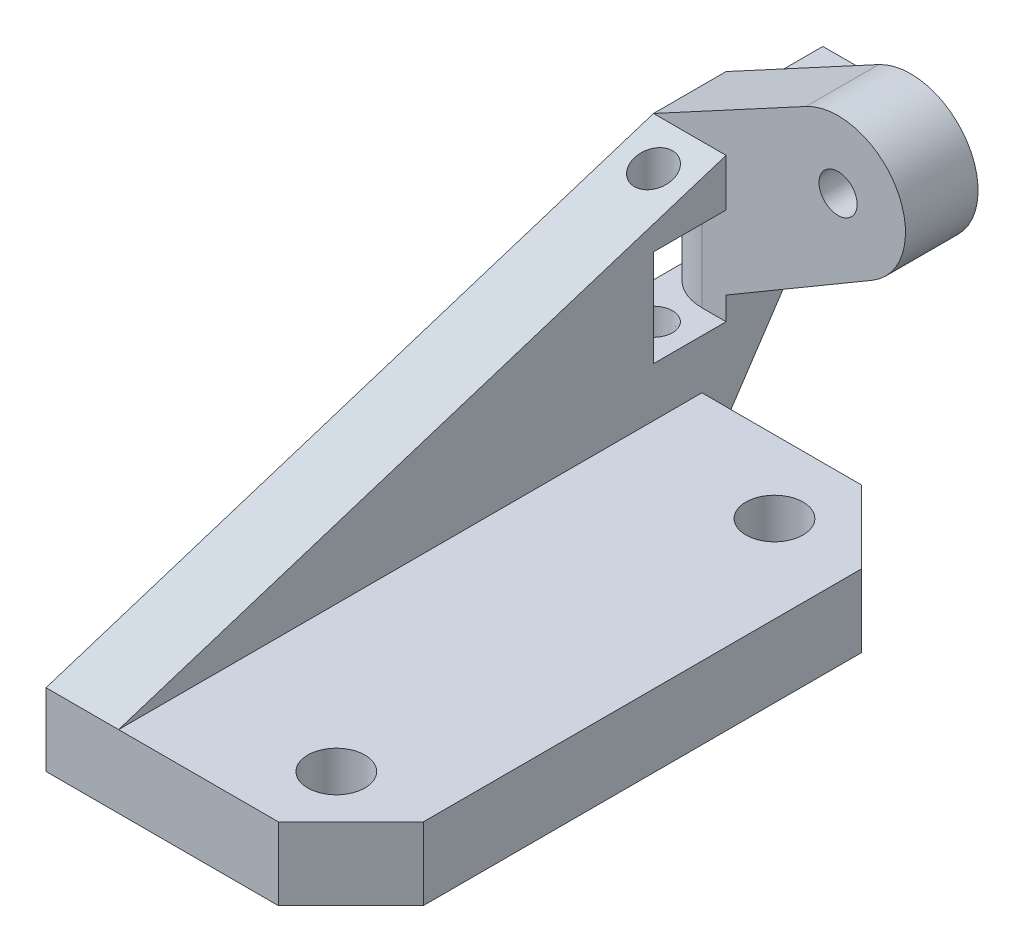
ISO-10303-21;
HEADER;
FILE_DESCRIPTION(('STEP AP214'),'2;1');
FILE_NAME('part.step','',(''),(''),'','','');
FILE_SCHEMA(('AUTOMOTIVE_DESIGN { 1 0 10303 214 1 1 1 1 }'));
ENDSEC;
DATA;
#1=APPLICATION_CONTEXT('core data for automotive mechanical design processes');
#2=APPLICATION_PROTOCOL_DEFINITION('international standard','automotive_design',2000,#1);
#3=PRODUCT_CONTEXT('',#1,'mechanical');
#4=PRODUCT('Part','Part','',(#3));
#5=PRODUCT_RELATED_PRODUCT_CATEGORY('part','',(#4));
#6=PRODUCT_DEFINITION_FORMATION('','',#4);
#7=PRODUCT_DEFINITION_CONTEXT('part definition',#1,'design');
#8=PRODUCT_DEFINITION('design','',#6,#7);
#9=PRODUCT_DEFINITION_SHAPE('','',#8);
#10=(LENGTH_UNIT() NAMED_UNIT(*) SI_UNIT(.MILLI.,.METRE.));
#11=(NAMED_UNIT(*) PLANE_ANGLE_UNIT() SI_UNIT($,.RADIAN.));
#12=(NAMED_UNIT(*) SI_UNIT($,.STERADIAN.) SOLID_ANGLE_UNIT());
#13=UNCERTAINTY_MEASURE_WITH_UNIT(LENGTH_MEASURE(1.E-05),#10,'distance_accuracy_value','');
#14=(GEOMETRIC_REPRESENTATION_CONTEXT(3) GLOBAL_UNCERTAINTY_ASSIGNED_CONTEXT((#13)) GLOBAL_UNIT_ASSIGNED_CONTEXT((#10,
#11,#12)) REPRESENTATION_CONTEXT('',''));
#15=CARTESIAN_POINT('',(0.,0.,0.));
#16=DIRECTION('',(0.,0.,1.));
#17=DIRECTION('',(1.,0.,0.));
#18=AXIS2_PLACEMENT_3D('',#15,#16,#17);
#19=CARTESIAN_POINT('',(-3.81000000000001,7.62,-35.7));
#20=DIRECTION('',(0.,0.,1.));
#21=DIRECTION('',(1.,0.,0.));
#22=AXIS2_PLACEMENT_3D('',#19,#20,#21);
#23=PLANE('',#22);
#24=DIRECTION('',(1.,0.,0.));
#25=VECTOR('',#24,1.);
#26=CARTESIAN_POINT('',(-3.81000000000001,9.398,-35.7));
#27=LINE('',#26,#25);
#28=CARTESIAN_POINT('',(-3.04800000000001,9.398,-35.7));
#29=VERTEX_POINT('',#28);
#30=CARTESIAN_POINT('',(-2.79400000000002,9.398,-35.7));
#31=VERTEX_POINT('',#30);
#32=EDGE_CURVE('E308',#29,#31,#27,.T.);
#33=ORIENTED_EDGE('',*,*,#32,.F.);
#34=DIRECTION('',(0.,-1.,0.));
#35=VECTOR('',#34,1.);
#36=CARTESIAN_POINT('',(-3.04800000000001,7.62,-35.7));
#37=LINE('',#36,#35);
#38=CARTESIAN_POINT('',(-3.04800000000001,10.795,-35.7));
#39=VERTEX_POINT('',#38);
#40=EDGE_CURVE('E53',#29,#39,#37,.F.);
#41=ORIENTED_EDGE('',*,*,#40,.T.);
#42=DIRECTION('',(-1.,0.,0.));
#43=VECTOR('',#42,1.);
#44=CARTESIAN_POINT('',(-3.81000000000001,10.795,-35.7));
#45=LINE('',#44,#43);
#46=CARTESIAN_POINT('',(-2.794,10.795,-35.7));
#47=VERTEX_POINT('',#46);
#48=EDGE_CURVE('E289',#47,#39,#45,.T.);
#49=ORIENTED_EDGE('',*,*,#48,.F.);
#50=DIRECTION('',(-0.707106781186548,-0.707106781186548,0.));
#51=VECTOR('',#50,1.);
#52=CARTESIAN_POINT('',(-4.88950000000001,8.6995,-35.7));
#53=LINE('',#52,#51);
#54=CARTESIAN_POINT('',(-2.03200000000001,11.557,-35.7));
#55=VERTEX_POINT('',#54);
#56=EDGE_CURVE('E415',#47,#55,#53,.F.);
#57=ORIENTED_EDGE('',*,*,#56,.T.);
#58=DIRECTION('',(0.,-1.,0.));
#59=VECTOR('',#58,1.);
#60=CARTESIAN_POINT('',(-2.03200000000001,10.795,-35.7));
#61=LINE('',#60,#59);
#62=CARTESIAN_POINT('',(-2.03200000000001,12.573,-35.7));
#63=VERTEX_POINT('',#62);
#64=EDGE_CURVE('E298',#63,#55,#61,.T.);
#65=ORIENTED_EDGE('',*,*,#64,.F.);
#66=DIRECTION('',(1.,0.,0.));
#67=VECTOR('',#66,1.);
#68=CARTESIAN_POINT('',(-3.81000000000001,12.573,-35.7));
#69=LINE('',#68,#67);
#70=CARTESIAN_POINT('',(-3.81000000000001,12.573,-35.7));
#71=VERTEX_POINT('',#70);
#72=EDGE_CURVE('E281',#71,#63,#69,.T.);
#73=ORIENTED_EDGE('',*,*,#72,.F.);
#74=DIRECTION('',(0.,-1.,0.));
#75=VECTOR('',#74,1.);
#76=CARTESIAN_POINT('',(-3.81000000000001,7.62,-35.7));
#77=LINE('',#76,#75);
#78=CARTESIAN_POINT('',(-3.81000000000001,13.97,-35.7));
#79=VERTEX_POINT('',#78);
#80=EDGE_CURVE('E337',#79,#71,#77,.T.);
#81=ORIENTED_EDGE('',*,*,#80,.F.);
#82=DIRECTION('',(0.879986355874397,0.474998961551391,0.));
#83=VECTOR('',#82,1.);
#84=CARTESIAN_POINT('',(4.19632177855796,18.2916516997954,-35.7));
#85=LINE('',#84,#83);
#86=CARTESIAN_POINT('',(4.19632177855796,18.2916516997954,-35.7));
#87=VERTEX_POINT('',#86);
#88=EDGE_CURVE('E273',#79,#87,#85,.T.);
#89=ORIENTED_EDGE('',*,*,#88,.T.);
#90=CARTESIAN_POINT('',(5.87781810244988,15.1765,-35.7));
#91=DIRECTION('',(0.,0.,-1.));
#92=DIRECTION('',(1.,0.,0.));
#93=AXIS2_PLACEMENT_3D('',#90,#91,#92);
#94=CIRCLE('',#93,3.54);
#95=CARTESIAN_POINT('',(7.67027951888549,12.1238483542026,-35.7));
#96=VERTEX_POINT('',#95);
#97=EDGE_CURVE('E261',#87,#96,#94,.T.);
#98=ORIENTED_EDGE('',*,*,#97,.T.);
#99=DIRECTION('',(-0.8623309733891,-0.506345032891414,0.));
#100=VECTOR('',#99,1.);
#101=CARTESIAN_POINT('',(0.,7.62,-35.7));
#102=LINE('',#101,#100);
#103=CARTESIAN_POINT('',(0.,7.62,-35.7));
#104=VERTEX_POINT('',#103);
#105=EDGE_CURVE('E255',#96,#104,#102,.T.);
#106=ORIENTED_EDGE('',*,*,#105,.T.);
#107=DIRECTION('',(1.,0.,0.));
#108=VECTOR('',#107,1.);
#109=CARTESIAN_POINT('',(-3.81000000000001,7.62,-35.7));
#110=LINE('',#109,#108);
#111=CARTESIAN_POINT('',(-2.03200000000001,7.62,-35.7));
#112=VERTEX_POINT('',#111);
#113=EDGE_CURVE('E356',#112,#104,#110,.T.);
#114=ORIENTED_EDGE('',*,*,#113,.F.);
#115=DIRECTION('',(0.,-1.,0.));
#116=VECTOR('',#115,1.);
#117=CARTESIAN_POINT('',(-2.03200000000001,7.62,-35.7));
#118=LINE('',#117,#116);
#119=CARTESIAN_POINT('',(-2.03200000000001,8.63599999999999,-35.7));
#120=VERTEX_POINT('',#119);
#121=EDGE_CURVE('E313',#120,#112,#118,.T.);
#122=ORIENTED_EDGE('',*,*,#121,.F.);
#123=DIRECTION('',(0.707106781186551,-0.707106781186544,0.));
#124=VECTOR('',#123,1.);
#125=CARTESIAN_POINT('',(-2.41300000000002,9.017,-35.7));
#126=LINE('',#125,#124);
#127=EDGE_CURVE('E417',#120,#31,#126,.F.);
#128=ORIENTED_EDGE('',*,*,#127,.T.);
#129=EDGE_LOOP('',(#33,#41,#49,#57,#65,#73,#81,#89,#98,#106,#114,#122,#128));
#130=FACE_BOUND('',#129,.T.);
#131=CARTESIAN_POINT('',(5.87781810244988,15.1765,-35.7));
#132=DIRECTION('',(0.,0.,-1.));
#133=DIRECTION('',(-1.,0.,0.));
#134=AXIS2_PLACEMENT_3D('',#131,#132,#133);
#135=CIRCLE('',#134,1.);
#136=CARTESIAN_POINT('',(4.87781810244988,15.1765,-35.7));
#137=VERTEX_POINT('',#136);
#138=EDGE_CURVE('E264',#137,#137,#135,.T.);
#139=ORIENTED_EDGE('',*,*,#138,.F.);
#140=EDGE_LOOP('',(#139));
#141=FACE_BOUND('',#140,.T.);
#142=ADVANCED_FACE('F38',(#130,#141),#23,.F.);
#143=CARTESIAN_POINT('',(0.,3.81,0.));
#144=DIRECTION('',(0.,-1.,0.));
#145=DIRECTION('',(0.,0.,-1.));
#146=AXIS2_PLACEMENT_3D('',#143,#144,#145);
#147=PLANE('',#146);
#148=DIRECTION('',(0.,0.,-1.));
#149=VECTOR('',#148,1.);
#150=CARTESIAN_POINT('',(12.192,3.81,0.));
#151=LINE('',#150,#149);
#152=CARTESIAN_POINT('',(12.192,3.81,-3.80999999999999));
#153=VERTEX_POINT('',#152);
#154=CARTESIAN_POINT('',(12.192,3.81,-26.81));
#155=VERTEX_POINT('',#154);
#156=EDGE_CURVE('E381',#153,#155,#151,.T.);
#157=ORIENTED_EDGE('',*,*,#156,.T.);
#158=DIRECTION('',(0.707106781186546,0.,0.707106781186549));
#159=VECTOR('',#158,1.);
#160=CARTESIAN_POINT('',(8.38200000000001,3.81,-30.62));
#161=LINE('',#160,#159);
#162=CARTESIAN_POINT('',(8.38200000000001,3.81,-30.62));
#163=VERTEX_POINT('',#162);
#164=EDGE_CURVE('E442',#155,#163,#161,.F.);
#165=ORIENTED_EDGE('',*,*,#164,.T.);
#166=DIRECTION('',(-1.,0.,0.));
#167=VECTOR('',#166,1.);
#168=CARTESIAN_POINT('',(0.,3.81,-30.62));
#169=LINE('',#168,#167);
#170=CARTESIAN_POINT('',(0.,3.81,-30.62));
#171=VERTEX_POINT('',#170);
#172=EDGE_CURVE('E384',#163,#171,#169,.T.);
#173=ORIENTED_EDGE('',*,*,#172,.T.);
#174=DIRECTION('',(0.,0.,1.));
#175=VECTOR('',#174,1.);
#176=CARTESIAN_POINT('',(0.,3.81,0.));
#177=LINE('',#176,#175);
#178=CARTESIAN_POINT('',(0.,3.81,0.));
#179=VERTEX_POINT('',#178);
#180=EDGE_CURVE('E374',#171,#179,#177,.T.);
#181=ORIENTED_EDGE('',*,*,#180,.T.);
#182=DIRECTION('',(1.,0.,0.));
#183=VECTOR('',#182,1.);
#184=CARTESIAN_POINT('',(0.,3.81,0.));
#185=LINE('',#184,#183);
#186=CARTESIAN_POINT('',(8.38199999999999,3.81,0.));
#187=VERTEX_POINT('',#186);
#188=EDGE_CURVE('E377',#179,#187,#185,.T.);
#189=ORIENTED_EDGE('',*,*,#188,.T.);
#190=DIRECTION('',(-0.70710678118655,0.,0.707106781186545));
#191=VECTOR('',#190,1.);
#192=CARTESIAN_POINT('',(12.192,3.81,-3.80999999999999));
#193=LINE('',#192,#191);
#194=EDGE_CURVE('E440',#187,#153,#193,.F.);
#195=ORIENTED_EDGE('',*,*,#194,.T.);
#196=EDGE_LOOP('',(#157,#165,#173,#181,#189,#195));
#197=FACE_BOUND('',#196,.T.);
#198=CARTESIAN_POINT('',(7.62,3.81,-26.81));
#199=DIRECTION('',(0.,1.,0.));
#200=DIRECTION('',(0.,0.,1.));
#201=AXIS2_PLACEMENT_3D('',#198,#199,#200);
#202=CIRCLE('',#201,1.5);
#203=CARTESIAN_POINT('',(7.62,3.81,-25.31));
#204=VERTEX_POINT('',#203);
#205=EDGE_CURVE('E368',#204,#204,#202,.T.);
#206=ORIENTED_EDGE('',*,*,#205,.F.);
#207=EDGE_LOOP('',(#206));
#208=FACE_BOUND('',#207,.T.);
#209=CARTESIAN_POINT('',(7.62,3.81,-3.81));
#210=DIRECTION('',(0.,1.,0.));
#211=DIRECTION('',(0.,0.,1.));
#212=AXIS2_PLACEMENT_3D('',#209,#210,#211);
#213=CIRCLE('',#212,1.5);
#214=CARTESIAN_POINT('',(7.62,3.81,-2.31));
#215=VERTEX_POINT('',#214);
#216=EDGE_CURVE('E362',#215,#215,#213,.T.);
#217=ORIENTED_EDGE('',*,*,#216,.F.);
#218=EDGE_LOOP('',(#217));
#219=FACE_BOUND('',#218,.T.);
#220=ADVANCED_FACE('F517',(#197,#208,#219),#147,.F.);
#221=CARTESIAN_POINT('',(0.,0.,0.));
#222=DIRECTION('',(0.,-1.,0.));
#223=DIRECTION('',(0.,0.,-1.));
#224=AXIS2_PLACEMENT_3D('',#221,#222,#223);
#225=PLANE('',#224);
#226=CARTESIAN_POINT('',(7.62,0.,-26.81));
#227=DIRECTION('',(0.,1.,0.));
#228=DIRECTION('',(0.,0.,1.));
#229=AXIS2_PLACEMENT_3D('',#226,#227,#228);
#230=CIRCLE('',#229,1.5);
#231=CARTESIAN_POINT('',(7.62,0.,-25.31));
#232=VERTEX_POINT('',#231);
#233=EDGE_CURVE('E365',#232,#232,#230,.T.);
#234=ORIENTED_EDGE('',*,*,#233,.T.);
#235=EDGE_LOOP('',(#234));
#236=FACE_BOUND('',#235,.T.);
#237=DIRECTION('',(-1.,0.,0.));
#238=VECTOR('',#237,1.);
#239=CARTESIAN_POINT('',(0.,0.,-30.62));
#240=LINE('',#239,#238);
#241=CARTESIAN_POINT('',(8.38200000000001,0.,-30.62));
#242=VERTEX_POINT('',#241);
#243=CARTESIAN_POINT('',(0.,0.,-30.62));
#244=VERTEX_POINT('',#243);
#245=EDGE_CURVE('E378',#242,#244,#240,.T.);
#246=ORIENTED_EDGE('',*,*,#245,.F.);
#247=DIRECTION('',(-0.707106781186546,0.,-0.707106781186549));
#248=VECTOR('',#247,1.);
#249=CARTESIAN_POINT('',(19.501,0.,-19.5009999999999));
#250=LINE('',#249,#248);
#251=CARTESIAN_POINT('',(12.192,0.,-26.81));
#252=VERTEX_POINT('',#251);
#253=EDGE_CURVE('E433',#242,#252,#250,.F.);
#254=ORIENTED_EDGE('',*,*,#253,.T.);
#255=DIRECTION('',(0.,0.,-1.));
#256=VECTOR('',#255,1.);
#257=CARTESIAN_POINT('',(12.192,0.,0.));
#258=LINE('',#257,#256);
#259=CARTESIAN_POINT('',(12.192,0.,-3.80999999999999));
#260=VERTEX_POINT('',#259);
#261=EDGE_CURVE('E389',#260,#252,#258,.T.);
#262=ORIENTED_EDGE('',*,*,#261,.F.);
#263=DIRECTION('',(0.70710678118655,0.,-0.707106781186545));
#264=VECTOR('',#263,1.);
#265=CARTESIAN_POINT('',(4.19099999999997,0.,4.19099999999999));
#266=LINE('',#265,#264);
#267=CARTESIAN_POINT('',(8.38199999999999,0.,0.));
#268=VERTEX_POINT('',#267);
#269=EDGE_CURVE('E431',#260,#268,#266,.F.);
#270=ORIENTED_EDGE('',*,*,#269,.T.);
#271=DIRECTION('',(1.,0.,0.));
#272=VECTOR('',#271,1.);
#273=CARTESIAN_POINT('',(0.,0.,0.));
#274=LINE('',#273,#272);
#275=CARTESIAN_POINT('',(-3.81,0.,0.));
#276=VERTEX_POINT('',#275);
#277=EDGE_CURVE('E371',#276,#268,#274,.T.);
#278=ORIENTED_EDGE('',*,*,#277,.F.);
#279=DIRECTION('',(0.,0.,1.));
#280=VECTOR('',#279,1.);
#281=CARTESIAN_POINT('',(-3.81000000000001,0.,-30.62));
#282=LINE('',#281,#280);
#283=CARTESIAN_POINT('',(-3.81000000000001,0.,-30.62));
#284=VERTEX_POINT('',#283);
#285=EDGE_CURVE('E342',#284,#276,#282,.T.);
#286=ORIENTED_EDGE('',*,*,#285,.F.);
#287=DIRECTION('',(1.,0.,0.));
#288=VECTOR('',#287,1.);
#289=CARTESIAN_POINT('',(-3.81000000000001,0.,-30.62));
#290=LINE('',#289,#288);
#291=EDGE_CURVE('E353',#284,#244,#290,.T.);
#292=ORIENTED_EDGE('',*,*,#291,.T.);
#293=EDGE_LOOP('',(#246,#254,#262,#270,#278,#286,#292));
#294=FACE_BOUND('',#293,.T.);
#295=CARTESIAN_POINT('',(7.62,0.,-3.81));
#296=DIRECTION('',(0.,1.,0.));
#297=DIRECTION('',(0.,0.,1.));
#298=AXIS2_PLACEMENT_3D('',#295,#296,#297);
#299=CIRCLE('',#298,1.5);
#300=CARTESIAN_POINT('',(7.62,0.,-2.31));
#301=VERTEX_POINT('',#300);
#302=EDGE_CURVE('E361',#301,#301,#299,.T.);
#303=ORIENTED_EDGE('',*,*,#302,.T.);
#304=EDGE_LOOP('',(#303));
#305=FACE_BOUND('',#304,.T.);
#306=ADVANCED_FACE('F507',(#236,#294,#305),#225,.T.);
#307=CARTESIAN_POINT('',(0.,3.81,0.));
#308=DIRECTION('',(0.,0.,-1.));
#309=DIRECTION('',(-1.,0.,0.));
#310=AXIS2_PLACEMENT_3D('',#307,#308,#309);
#311=PLANE('',#310);
#312=ORIENTED_EDGE('',*,*,#277,.T.);
#313=DIRECTION('',(0.,1.,0.));
#314=VECTOR('',#313,1.);
#315=CARTESIAN_POINT('',(8.38199999999999,3.81,0.));
#316=LINE('',#315,#314);
#317=EDGE_CURVE('E444',#268,#187,#316,.T.);
#318=ORIENTED_EDGE('',*,*,#317,.T.);
#319=ORIENTED_EDGE('',*,*,#188,.F.);
#320=DIRECTION('',(1.,0.,0.));
#321=VECTOR('',#320,1.);
#322=CARTESIAN_POINT('',(-3.81,3.81,0.));
#323=LINE('',#322,#321);
#324=CARTESIAN_POINT('',(-3.81,3.81,0.));
#325=VERTEX_POINT('',#324);
#326=EDGE_CURVE('E347',#325,#179,#323,.T.);
#327=ORIENTED_EDGE('',*,*,#326,.F.);
#328=DIRECTION('',(0.,1.,0.));
#329=VECTOR('',#328,1.);
#330=CARTESIAN_POINT('',(-3.81,3.81,0.));
#331=LINE('',#330,#329);
#332=EDGE_CURVE('E345',#276,#325,#331,.T.);
#333=ORIENTED_EDGE('',*,*,#332,.F.);
#334=EDGE_LOOP('',(#312,#318,#319,#327,#333));
#335=FACE_BOUND('',#334,.T.);
#336=ADVANCED_FACE('F512',(#335),#311,.F.);
#337=CARTESIAN_POINT('',(12.192,3.81,0.));
#338=DIRECTION('',(-1.,0.,0.));
#339=DIRECTION('',(0.,0.,1.));
#340=AXIS2_PLACEMENT_3D('',#337,#338,#339);
#341=PLANE('',#340);
#342=ORIENTED_EDGE('',*,*,#261,.T.);
#343=DIRECTION('',(0.,1.,0.));
#344=VECTOR('',#343,1.);
#345=CARTESIAN_POINT('',(12.192,3.81,-26.81));
#346=LINE('',#345,#344);
#347=EDGE_CURVE('E438',#252,#155,#346,.T.);
#348=ORIENTED_EDGE('',*,*,#347,.T.);
#349=ORIENTED_EDGE('',*,*,#156,.F.);
#350=DIRECTION('',(0.,-1.,0.));
#351=VECTOR('',#350,1.);
#352=CARTESIAN_POINT('',(12.192,3.81,-3.80999999999999));
#353=LINE('',#352,#351);
#354=EDGE_CURVE('E435',#153,#260,#353,.T.);
#355=ORIENTED_EDGE('',*,*,#354,.T.);
#356=EDGE_LOOP('',(#342,#348,#349,#355));
#357=FACE_BOUND('',#356,.T.);
#358=ADVANCED_FACE('F530',(#357),#341,.F.);
#359=CARTESIAN_POINT('',(0.,3.81,-30.62));
#360=DIRECTION('',(0.,0.,1.));
#361=DIRECTION('',(1.,0.,0.));
#362=AXIS2_PLACEMENT_3D('',#359,#360,#361);
#363=PLANE('',#362);
#364=ORIENTED_EDGE('',*,*,#172,.F.);
#365=DIRECTION('',(0.,-1.,0.));
#366=VECTOR('',#365,1.);
#367=CARTESIAN_POINT('',(8.38200000000001,3.81,-30.62));
#368=LINE('',#367,#366);
#369=EDGE_CURVE('E428',#163,#242,#368,.T.);
#370=ORIENTED_EDGE('',*,*,#369,.T.);
#371=ORIENTED_EDGE('',*,*,#245,.T.);
#372=DIRECTION('',(0.,-1.,0.));
#373=VECTOR('',#372,1.);
#374=CARTESIAN_POINT('',(0.,3.81,-30.62));
#375=LINE('',#374,#373);
#376=EDGE_CURVE('E386',#171,#244,#375,.T.);
#377=ORIENTED_EDGE('',*,*,#376,.F.);
#378=EDGE_LOOP('',(#364,#370,#371,#377));
#379=FACE_BOUND('',#378,.T.);
#380=ADVANCED_FACE('F524',(#379),#363,.F.);
#381=CARTESIAN_POINT('',(7.62,3.81,-26.81));
#382=DIRECTION('',(0.,-1.,0.));
#383=DIRECTION('',(0.,0.,-1.));
#384=AXIS2_PLACEMENT_3D('',#381,#382,#383);
#385=CYLINDRICAL_SURFACE('',#384,1.5);
#386=ORIENTED_EDGE('',*,*,#205,.T.);
#387=EDGE_LOOP('',(#386));
#388=FACE_BOUND('',#387,.T.);
#389=ORIENTED_EDGE('',*,*,#233,.F.);
#390=EDGE_LOOP('',(#389));
#391=FACE_BOUND('',#390,.T.);
#392=ADVANCED_FACE('F558',(#388,#391),#385,.F.);
#393=CARTESIAN_POINT('',(7.62,3.81,-3.81));
#394=DIRECTION('',(0.,-1.,0.));
#395=DIRECTION('',(0.,0.,-1.));
#396=AXIS2_PLACEMENT_3D('',#393,#394,#395);
#397=CYLINDRICAL_SURFACE('',#396,1.5);
#398=ORIENTED_EDGE('',*,*,#216,.T.);
#399=EDGE_LOOP('',(#398));
#400=FACE_BOUND('',#399,.T.);
#401=ORIENTED_EDGE('',*,*,#302,.F.);
#402=EDGE_LOOP('',(#401));
#403=FACE_BOUND('',#402,.T.);
#404=ADVANCED_FACE('F555',(#400,#403),#397,.F.);
#405=CARTESIAN_POINT('',(0.,0.,0.));
#406=DIRECTION('',(1.,0.,0.));
#407=DIRECTION('',(0.,0.,-1.));
#408=AXIS2_PLACEMENT_3D('',#405,#406,#407);
#409=PLANE('',#408);
#410=DIRECTION('',(0.,-1.,0.));
#411=VECTOR('',#410,1.);
#412=CARTESIAN_POINT('',(0.,11.4861523988711,-31.89));
#413=LINE('',#412,#411);
#414=CARTESIAN_POINT('',(0.,7.62,-31.89));
#415=VERTEX_POINT('',#414);
#416=CARTESIAN_POINT('',(0.,6.40615239887112,-31.89));
#417=VERTEX_POINT('',#416);
#418=EDGE_CURVE('E247',#415,#417,#413,.T.);
#419=ORIENTED_EDGE('',*,*,#418,.T.);
#420=DIRECTION('',(0.,0.,1.));
#421=VECTOR('',#420,1.);
#422=CARTESIAN_POINT('',(0.,6.40615239887112,-31.89));
#423=LINE('',#422,#421);
#424=CARTESIAN_POINT('',(0.,6.40615239887112,-28.08));
#425=VERTEX_POINT('',#424);
#426=EDGE_CURVE('E235',#417,#425,#423,.T.);
#427=ORIENTED_EDGE('',*,*,#426,.T.);
#428=DIRECTION('',(0.,1.,0.));
#429=VECTOR('',#428,1.);
#430=CARTESIAN_POINT('',(0.,11.4861523988711,-28.08));
#431=LINE('',#430,#429);
#432=CARTESIAN_POINT('',(0.,11.4861523988711,-28.08));
#433=VERTEX_POINT('',#432);
#434=EDGE_CURVE('E246',#425,#433,#431,.T.);
#435=ORIENTED_EDGE('',*,*,#434,.T.);
#436=DIRECTION('',(0.,0.,-1.));
#437=VECTOR('',#436,1.);
#438=CARTESIAN_POINT('',(0.,11.4861523988711,-31.89));
#439=LINE('',#438,#437);
#440=CARTESIAN_POINT('',(0.,11.4861523988711,-31.89));
#441=VERTEX_POINT('',#440);
#442=EDGE_CURVE('E227',#433,#441,#439,.T.);
#443=ORIENTED_EDGE('',*,*,#442,.T.);
#444=DIRECTION('',(0.,1.,0.));
#445=VECTOR('',#444,1.);
#446=CARTESIAN_POINT('',(0.,13.97,-31.89));
#447=LINE('',#446,#445);
#448=CARTESIAN_POINT('',(0.,13.97,-31.89));
#449=VERTEX_POINT('',#448);
#450=EDGE_CURVE('E243',#441,#449,#447,.T.);
#451=ORIENTED_EDGE('',*,*,#450,.T.);
#452=DIRECTION('',(0.,0.303561275960176,-0.952811918343505));
#453=VECTOR('',#452,1.);
#454=CARTESIAN_POINT('',(0.,13.97,-31.89));
#455=LINE('',#454,#453);
#456=EDGE_CURVE('E329',#179,#449,#455,.T.);
#457=ORIENTED_EDGE('',*,*,#456,.F.);
#458=ORIENTED_EDGE('',*,*,#180,.F.);
#459=ORIENTED_EDGE('',*,*,#376,.T.);
#460=DIRECTION('',(0.,-0.832050294337844,0.554700196225229));
#461=VECTOR('',#460,1.);
#462=CARTESIAN_POINT('',(0.,0.,-30.62));
#463=LINE('',#462,#461);
#464=EDGE_CURVE('E334',#104,#244,#463,.T.);
#465=ORIENTED_EDGE('',*,*,#464,.F.);
#466=DIRECTION('',(0.,0.,-1.));
#467=VECTOR('',#466,1.);
#468=CARTESIAN_POINT('',(0.,7.62,-31.89));
#469=LINE('',#468,#467);
#470=EDGE_CURVE('E279',#415,#104,#469,.T.);
#471=ORIENTED_EDGE('',*,*,#470,.F.);
#472=EDGE_LOOP('',(#419,#427,#435,#443,#451,#457,#458,#459,#465,#471));
#473=FACE_BOUND('',#472,.T.);
#474=ADVANCED_FACE('F241',(#473),#409,.T.);
#475=CARTESIAN_POINT('',(-3.81000000000001,13.97,-31.89));
#476=DIRECTION('',(0.,-0.952811918343505,-0.303561275960176));
#477=DIRECTION('',(0.,0.303561275960176,-0.952811918343505));
#478=AXIS2_PLACEMENT_3D('',#475,#476,#477);
#479=PLANE('',#478);
#480=CARTESIAN_POINT('',(-1.905,13.3630761994356,-29.985));
#481=DIRECTION('',(0.,-0.952811918343505,-0.303561275960176));
#482=DIRECTION('',(0.,-0.303561275960176,0.952811918343505));
#483=AXIS2_PLACEMENT_3D('',#480,#481,#482);
#484=ELLIPSE('',#483,1.04952507493665,1.);
#485=CARTESIAN_POINT('',(-1.905,13.0444810285356,-28.985));
#486=VERTEX_POINT('',#485);
#487=EDGE_CURVE('E916',#486,#486,#484,.F.);
#488=ORIENTED_EDGE('',*,*,#487,.F.);
#489=EDGE_LOOP('',(#488));
#490=FACE_BOUND('',#489,.T.);
#491=ORIENTED_EDGE('',*,*,#456,.T.);
#492=DIRECTION('',(1.,0.,0.));
#493=VECTOR('',#492,1.);
#494=CARTESIAN_POINT('',(-3.81000000000001,13.97,-31.89));
#495=LINE('',#494,#493);
#496=CARTESIAN_POINT('',(-3.81000000000001,13.97,-31.89));
#497=VERTEX_POINT('',#496);
#498=EDGE_CURVE('E252',#497,#449,#495,.T.);
#499=ORIENTED_EDGE('',*,*,#498,.F.);
#500=DIRECTION('',(0.,0.303561275960176,-0.952811918343505));
#501=VECTOR('',#500,1.);
#502=CARTESIAN_POINT('',(-3.81000000000001,13.97,-31.89));
#503=LINE('',#502,#501);
#504=EDGE_CURVE('E330',#325,#497,#503,.T.);
#505=ORIENTED_EDGE('',*,*,#504,.F.);
#506=ORIENTED_EDGE('',*,*,#326,.T.);
#507=EDGE_LOOP('',(#491,#499,#505,#506));
#508=FACE_BOUND('',#507,.T.);
#509=ADVANCED_FACE('F515',(#490,#508),#479,.F.);
#510=CARTESIAN_POINT('',(-3.81000000000001,0.,-30.62));
#511=DIRECTION('',(0.,0.554700196225229,0.832050294337843));
#512=DIRECTION('',(0.,-0.832050294337844,0.554700196225229));
#513=AXIS2_PLACEMENT_3D('',#510,#511,#512);
#514=PLANE('',#513);
#515=ORIENTED_EDGE('',*,*,#464,.T.);
#516=ORIENTED_EDGE('',*,*,#291,.F.);
#517=DIRECTION('',(0.,-0.832050294337844,0.554700196225229));
#518=VECTOR('',#517,1.);
#519=CARTESIAN_POINT('',(-3.81000000000001,0.,-30.62));
#520=LINE('',#519,#518);
#521=CARTESIAN_POINT('',(-3.81000000000001,7.62,-35.7));
#522=VERTEX_POINT('',#521);
#523=EDGE_CURVE('E340',#522,#284,#520,.T.);
#524=ORIENTED_EDGE('',*,*,#523,.F.);
#525=EDGE_CURVE('E357',#522,#112,#110,.T.);
#526=ORIENTED_EDGE('',*,*,#525,.T.);
#527=ORIENTED_EDGE('',*,*,#113,.T.);
#528=EDGE_LOOP('',(#515,#516,#524,#526,#527));
#529=FACE_BOUND('',#528,.T.);
#530=ADVANCED_FACE('F503',(#529),#514,.F.);
#531=CARTESIAN_POINT('',(-3.81,0.,0.));
#532=DIRECTION('',(1.,0.,0.));
#533=DIRECTION('',(0.,0.,-1.));
#534=AXIS2_PLACEMENT_3D('',#531,#532,#533);
#535=PLANE('',#534);
#536=DIRECTION('',(0.,0.,1.));
#537=VECTOR('',#536,1.);
#538=CARTESIAN_POINT('',(-3.81000000000001,6.40615239887112,-31.89));
#539=LINE('',#538,#537);
#540=CARTESIAN_POINT('',(-3.81000000000001,6.40615239887112,-34.43));
#541=VERTEX_POINT('',#540);
#542=CARTESIAN_POINT('',(-3.81000000000001,6.40615239887112,-28.08));
#543=VERTEX_POINT('',#542);
#544=EDGE_CURVE('E910',#541,#543,#539,.T.);
#545=ORIENTED_EDGE('',*,*,#544,.F.);
#546=DIRECTION('',(0.,-1.,0.));
#547=VECTOR('',#546,1.);
#548=CARTESIAN_POINT('',(-3.81000000000001,11.4861523988711,-34.43));
#549=LINE('',#548,#547);
#550=CARTESIAN_POINT('',(-3.81000000000001,11.4861523988711,-34.43));
#551=VERTEX_POINT('',#550);
#552=EDGE_CURVE('E421',#541,#551,#549,.F.);
#553=ORIENTED_EDGE('',*,*,#552,.T.);
#554=DIRECTION('',(0.,0.,-1.));
#555=VECTOR('',#554,1.);
#556=CARTESIAN_POINT('',(-3.81000000000001,11.4861523988711,-31.89));
#557=LINE('',#556,#555);
#558=CARTESIAN_POINT('',(-3.81000000000001,11.4861523988711,-28.08));
#559=VERTEX_POINT('',#558);
#560=EDGE_CURVE('E608',#559,#551,#557,.T.);
#561=ORIENTED_EDGE('',*,*,#560,.F.);
#562=DIRECTION('',(0.,1.,0.));
#563=VECTOR('',#562,1.);
#564=CARTESIAN_POINT('',(-3.81000000000001,11.4861523988711,-28.08));
#565=LINE('',#564,#563);
#566=EDGE_CURVE('E611',#543,#559,#565,.T.);
#567=ORIENTED_EDGE('',*,*,#566,.F.);
#568=EDGE_LOOP('',(#545,#553,#561,#567));
#569=FACE_BOUND('',#568,.T.);
#570=DIRECTION('',(0.,-1.,0.));
#571=VECTOR('',#570,1.);
#572=CARTESIAN_POINT('',(-3.81000000000001,0.,-34.938));
#573=LINE('',#572,#571);
#574=CARTESIAN_POINT('',(-3.81000000000001,10.795,-34.938));
#575=VERTEX_POINT('',#574);
#576=CARTESIAN_POINT('',(-3.81000000000001,8.63599999999999,-34.938));
#577=VERTEX_POINT('',#576);
#578=EDGE_CURVE('E446',#575,#577,#573,.T.);
#579=ORIENTED_EDGE('',*,*,#578,.T.);
#580=DIRECTION('',(0.,0.,-1.));
#581=VECTOR('',#580,1.);
#582=CARTESIAN_POINT('',(-3.81,8.63599999999999,0.));
#583=LINE('',#582,#581);
#584=CARTESIAN_POINT('',(-3.81000000000001,8.63599999999999,-40.78));
#585=VERTEX_POINT('',#584);
#586=EDGE_CURVE('E61',#577,#585,#583,.T.);
#587=ORIENTED_EDGE('',*,*,#586,.T.);
#588=DIRECTION('',(0.,1.,0.));
#589=VECTOR('',#588,1.);
#590=CARTESIAN_POINT('',(-3.81000000000001,7.62,-40.78));
#591=LINE('',#590,#589);
#592=CARTESIAN_POINT('',(-3.81000000000001,7.62,-40.78));
#593=VERTEX_POINT('',#592);
#594=EDGE_CURVE('E309',#593,#585,#591,.T.);
#595=ORIENTED_EDGE('',*,*,#594,.F.);
#596=DIRECTION('',(0.,0.,1.));
#597=VECTOR('',#596,1.);
#598=CARTESIAN_POINT('',(-3.81000000000001,7.62,-40.78));
#599=LINE('',#598,#597);
#600=EDGE_CURVE('E320',#593,#522,#599,.T.);
#601=ORIENTED_EDGE('',*,*,#600,.T.);
#602=ORIENTED_EDGE('',*,*,#523,.T.);
#603=ORIENTED_EDGE('',*,*,#285,.T.);
#604=ORIENTED_EDGE('',*,*,#332,.T.);
#605=ORIENTED_EDGE('',*,*,#504,.T.);
#606=DIRECTION('',(0.,0.,-1.));
#607=VECTOR('',#606,1.);
#608=CARTESIAN_POINT('',(-3.81000000000001,13.97,-35.7));
#609=LINE('',#608,#607);
#610=EDGE_CURVE('E333',#497,#79,#609,.T.);
#611=ORIENTED_EDGE('',*,*,#610,.T.);
#612=ORIENTED_EDGE('',*,*,#80,.T.);
#613=DIRECTION('',(0.,0.,1.));
#614=VECTOR('',#613,1.);
#615=CARTESIAN_POINT('',(-3.81000000000001,12.573,-40.78));
#616=LINE('',#615,#614);
#617=CARTESIAN_POINT('',(-3.81000000000001,12.573,-40.78));
#618=VERTEX_POINT('',#617);
#619=EDGE_CURVE('E306',#618,#71,#616,.T.);
#620=ORIENTED_EDGE('',*,*,#619,.F.);
#621=DIRECTION('',(0.,1.,0.));
#622=VECTOR('',#621,1.);
#623=CARTESIAN_POINT('',(-3.81000000000001,10.795,-40.78));
#624=LINE('',#623,#622);
#625=CARTESIAN_POINT('',(-3.81000000000001,10.795,-40.78));
#626=VERTEX_POINT('',#625);
#627=EDGE_CURVE('E285',#626,#618,#624,.T.);
#628=ORIENTED_EDGE('',*,*,#627,.F.);
#629=DIRECTION('',(0.,0.,1.));
#630=VECTOR('',#629,1.);
#631=CARTESIAN_POINT('',(-3.81000000000001,10.795,-40.78));
#632=LINE('',#631,#630);
#633=EDGE_CURVE('E296',#626,#575,#632,.T.);
#634=ORIENTED_EDGE('',*,*,#633,.T.);
#635=EDGE_LOOP('',(#579,#587,#595,#601,#602,#603,#604,#605,#611,#612,#620,#628,#634));
#636=FACE_BOUND('',#635,.T.);
#637=ADVANCED_FACE('F483',(#569,#636),#535,.F.);
#638=CARTESIAN_POINT('',(-3.81000000000001,9.398,-40.78));
#639=DIRECTION('',(0.,-1.,0.));
#640=DIRECTION('',(0.,0.,-1.));
#641=AXIS2_PLACEMENT_3D('',#638,#639,#640);
#642=PLANE('',#641);
#643=ORIENTED_EDGE('',*,*,#32,.T.);
#644=DIRECTION('',(0.,0.,-1.));
#645=VECTOR('',#644,1.);
#646=CARTESIAN_POINT('',(-2.79400000000002,9.398,-40.78));
#647=LINE('',#646,#645);
#648=CARTESIAN_POINT('',(-2.79400000000002,9.398,-40.78));
#649=VERTEX_POINT('',#648);
#650=EDGE_CURVE('E408',#31,#649,#647,.T.);
#651=ORIENTED_EDGE('',*,*,#650,.T.);
#652=DIRECTION('',(1.,0.,0.));
#653=VECTOR('',#652,1.);
#654=CARTESIAN_POINT('',(-3.81000000000001,9.398,-40.78));
#655=LINE('',#654,#653);
#656=CARTESIAN_POINT('',(-3.04800000000001,9.398,-40.78));
#657=VERTEX_POINT('',#656);
#658=EDGE_CURVE('E312',#657,#649,#655,.T.);
#659=ORIENTED_EDGE('',*,*,#658,.F.);
#660=DIRECTION('',(0.,0.,1.));
#661=VECTOR('',#660,1.);
#662=CARTESIAN_POINT('',(-3.04800000000001,9.398,-40.78));
#663=LINE('',#662,#661);
#664=EDGE_CURVE('E405',#657,#29,#663,.T.);
#665=ORIENTED_EDGE('',*,*,#664,.T.);
#666=EDGE_LOOP('',(#643,#651,#659,#665));
#667=FACE_BOUND('',#666,.T.);
#668=ADVANCED_FACE('F455',(#667),#642,.F.);
#669=CARTESIAN_POINT('',(-2.03200000000001,7.62,-40.78));
#670=DIRECTION('',(-1.,0.,0.));
#671=DIRECTION('',(0.,0.,1.));
#672=AXIS2_PLACEMENT_3D('',#669,#670,#671);
#673=PLANE('',#672);
#674=DIRECTION('',(0.,-1.,0.));
#675=VECTOR('',#674,1.);
#676=CARTESIAN_POINT('',(-2.03200000000001,7.62,-40.78));
#677=LINE('',#676,#675);
#678=CARTESIAN_POINT('',(-2.03200000000001,8.63599999999999,-40.78));
#679=VERTEX_POINT('',#678);
#680=CARTESIAN_POINT('',(-2.03200000000001,7.62,-40.78));
#681=VERTEX_POINT('',#680);
#682=EDGE_CURVE('E316',#679,#681,#677,.T.);
#683=ORIENTED_EDGE('',*,*,#682,.F.);
#684=DIRECTION('',(0.,0.,1.));
#685=VECTOR('',#684,1.);
#686=CARTESIAN_POINT('',(-2.03200000000001,8.63599999999999,-40.78));
#687=LINE('',#686,#685);
#688=EDGE_CURVE('E402',#679,#120,#687,.T.);
#689=ORIENTED_EDGE('',*,*,#688,.T.);
#690=ORIENTED_EDGE('',*,*,#121,.T.);
#691=DIRECTION('',(0.,0.,1.));
#692=VECTOR('',#691,1.);
#693=CARTESIAN_POINT('',(-2.03200000000001,7.62,-40.78));
#694=LINE('',#693,#692);
#695=EDGE_CURVE('E326',#681,#112,#694,.T.);
#696=ORIENTED_EDGE('',*,*,#695,.F.);
#697=EDGE_LOOP('',(#683,#689,#690,#696));
#698=FACE_BOUND('',#697,.T.);
#699=ADVANCED_FACE('F657',(#698),#673,.F.);
#700=CARTESIAN_POINT('',(-3.81000000000001,7.62,-40.78));
#701=DIRECTION('',(0.,1.,0.));
#702=DIRECTION('',(-1.,0.,0.));
#703=AXIS2_PLACEMENT_3D('',#700,#701,#702);
#704=PLANE('',#703);
#705=ORIENTED_EDGE('',*,*,#525,.F.);
#706=ORIENTED_EDGE('',*,*,#600,.F.);
#707=DIRECTION('',(-1.,0.,0.));
#708=VECTOR('',#707,1.);
#709=CARTESIAN_POINT('',(-3.81000000000001,7.62,-40.78));
#710=LINE('',#709,#708);
#711=EDGE_CURVE('E318',#681,#593,#710,.T.);
#712=ORIENTED_EDGE('',*,*,#711,.F.);
#713=ORIENTED_EDGE('',*,*,#695,.T.);
#714=EDGE_LOOP('',(#705,#706,#712,#713));
#715=FACE_BOUND('',#714,.T.);
#716=ADVANCED_FACE('F653',(#715),#704,.F.);
#717=CARTESIAN_POINT('',(0.,0.,-40.78));
#718=DIRECTION('',(0.,0.,-1.));
#719=DIRECTION('',(-1.,0.,0.));
#720=AXIS2_PLACEMENT_3D('',#717,#718,#719);
#721=PLANE('',#720);
#722=ORIENTED_EDGE('',*,*,#658,.T.);
#723=DIRECTION('',(-0.707106781186551,0.707106781186544,0.));
#724=VECTOR('',#723,1.);
#725=CARTESIAN_POINT('',(3.302,3.30200000000003,-40.78));
#726=LINE('',#725,#724);
#727=EDGE_CURVE('E412',#649,#679,#726,.F.);
#728=ORIENTED_EDGE('',*,*,#727,.T.);
#729=ORIENTED_EDGE('',*,*,#682,.T.);
#730=ORIENTED_EDGE('',*,*,#711,.T.);
#731=ORIENTED_EDGE('',*,*,#594,.T.);
#732=DIRECTION('',(-0.707106781186544,-0.707106781186551,0.));
#733=VECTOR('',#732,1.);
#734=CARTESIAN_POINT('',(-6.22300000000002,6.22299999999996,-40.78));
#735=LINE('',#734,#733);
#736=EDGE_CURVE('E410',#585,#657,#735,.F.);
#737=ORIENTED_EDGE('',*,*,#736,.T.);
#738=EDGE_LOOP('',(#722,#728,#729,#730,#731,#737));
#739=FACE_BOUND('',#738,.T.);
#740=ADVANCED_FACE('F650',(#739),#721,.T.);
#741=CARTESIAN_POINT('',(-3.81000000000001,12.573,-40.78));
#742=DIRECTION('',(0.,-1.,0.));
#743=DIRECTION('',(0.,0.,-1.));
#744=AXIS2_PLACEMENT_3D('',#741,#742,#743);
#745=PLANE('',#744);
#746=ORIENTED_EDGE('',*,*,#72,.T.);
#747=DIRECTION('',(0.,0.,1.));
#748=VECTOR('',#747,1.);
#749=CARTESIAN_POINT('',(-2.03200000000001,12.573,-40.78));
#750=LINE('',#749,#748);
#751=CARTESIAN_POINT('',(-2.03200000000001,12.573,-40.78));
#752=VERTEX_POINT('',#751);
#753=EDGE_CURVE('E303',#752,#63,#750,.T.);
#754=ORIENTED_EDGE('',*,*,#753,.F.);
#755=DIRECTION('',(1.,0.,0.));
#756=VECTOR('',#755,1.);
#757=CARTESIAN_POINT('',(-3.81000000000001,12.573,-40.78));
#758=LINE('',#757,#756);
#759=EDGE_CURVE('E288',#618,#752,#758,.T.);
#760=ORIENTED_EDGE('',*,*,#759,.F.);
#761=ORIENTED_EDGE('',*,*,#619,.T.);
#762=EDGE_LOOP('',(#746,#754,#760,#761));
#763=FACE_BOUND('',#762,.T.);
#764=ADVANCED_FACE('F480',(#763),#745,.F.);
#765=CARTESIAN_POINT('',(-2.03200000000001,10.795,-40.78));
#766=DIRECTION('',(-1.,0.,0.));
#767=DIRECTION('',(0.,0.,1.));
#768=AXIS2_PLACEMENT_3D('',#765,#766,#767);
#769=PLANE('',#768);
#770=ORIENTED_EDGE('',*,*,#64,.T.);
#771=DIRECTION('',(0.,0.,-1.));
#772=VECTOR('',#771,1.);
#773=CARTESIAN_POINT('',(-2.03200000000001,11.557,-40.78));
#774=LINE('',#773,#772);
#775=CARTESIAN_POINT('',(-2.03200000000001,11.557,-40.78));
#776=VERTEX_POINT('',#775);
#777=EDGE_CURVE('E398',#55,#776,#774,.T.);
#778=ORIENTED_EDGE('',*,*,#777,.T.);
#779=DIRECTION('',(0.,-1.,0.));
#780=VECTOR('',#779,1.);
#781=CARTESIAN_POINT('',(-2.03200000000001,10.795,-40.78));
#782=LINE('',#781,#780);
#783=EDGE_CURVE('E291',#752,#776,#782,.T.);
#784=ORIENTED_EDGE('',*,*,#783,.F.);
#785=ORIENTED_EDGE('',*,*,#753,.T.);
#786=EDGE_LOOP('',(#770,#778,#784,#785));
#787=FACE_BOUND('',#786,.T.);
#788=ADVANCED_FACE('F471',(#787),#769,.F.);
#789=CARTESIAN_POINT('',(-3.81000000000001,10.795,-40.78));
#790=DIRECTION('',(0.,1.,0.));
#791=DIRECTION('',(0.,0.,1.));
#792=AXIS2_PLACEMENT_3D('',#789,#790,#791);
#793=PLANE('',#792);
#794=DIRECTION('',(-1.,0.,0.));
#795=VECTOR('',#794,1.);
#796=CARTESIAN_POINT('',(-3.81000000000001,10.795,-40.78));
#797=LINE('',#796,#795);
#798=CARTESIAN_POINT('',(-2.794,10.795,-40.78));
#799=VERTEX_POINT('',#798);
#800=EDGE_CURVE('E294',#799,#626,#797,.T.);
#801=ORIENTED_EDGE('',*,*,#800,.F.);
#802=DIRECTION('',(0.,0.,1.));
#803=VECTOR('',#802,1.);
#804=CARTESIAN_POINT('',(-2.794,10.795,-40.78));
#805=LINE('',#804,#803);
#806=EDGE_CURVE('E395',#799,#47,#805,.T.);
#807=ORIENTED_EDGE('',*,*,#806,.T.);
#808=ORIENTED_EDGE('',*,*,#48,.T.);
#809=CARTESIAN_POINT('',(-3.04800000000001,10.795,-34.938));
#810=DIRECTION('',(0.,1.,0.));
#811=DIRECTION('',(0.,0.,1.));
#812=AXIS2_PLACEMENT_3D('',#809,#810,#811);
#813=CIRCLE('',#812,0.762);
#814=EDGE_CURVE('E11',#39,#575,#813,.T.);
#815=ORIENTED_EDGE('',*,*,#814,.T.);
#816=ORIENTED_EDGE('',*,*,#633,.F.);
#817=EDGE_LOOP('',(#801,#807,#808,#815,#816));
#818=FACE_BOUND('',#817,.T.);
#819=ADVANCED_FACE('F463',(#818),#793,.F.);
#820=CARTESIAN_POINT('',(0.,0.,-40.78));
#821=DIRECTION('',(0.,0.,-1.));
#822=DIRECTION('',(-1.,0.,0.));
#823=AXIS2_PLACEMENT_3D('',#820,#821,#822);
#824=PLANE('',#823);
#825=ORIENTED_EDGE('',*,*,#783,.T.);
#826=DIRECTION('',(0.707106781186548,0.707106781186548,0.));
#827=VECTOR('',#826,1.);
#828=CARTESIAN_POINT('',(-6.7945,6.7945,-40.78));
#829=LINE('',#828,#827);
#830=EDGE_CURVE('E400',#776,#799,#829,.F.);
#831=ORIENTED_EDGE('',*,*,#830,.T.);
#832=ORIENTED_EDGE('',*,*,#800,.T.);
#833=ORIENTED_EDGE('',*,*,#627,.T.);
#834=ORIENTED_EDGE('',*,*,#759,.T.);
#835=EDGE_LOOP('',(#825,#831,#832,#833,#834));
#836=FACE_BOUND('',#835,.T.);
#837=ADVANCED_FACE('F477',(#836),#824,.T.);
#838=CARTESIAN_POINT('',(0.,7.62,-31.89));
#839=DIRECTION('',(0.506345032891414,-0.8623309733891,0.));
#840=DIRECTION('',(0.8623309733891,0.506345032891414,0.));
#841=AXIS2_PLACEMENT_3D('',#838,#839,#840);
#842=PLANE('',#841);
#843=ORIENTED_EDGE('',*,*,#105,.F.);
#844=DIRECTION('',(0.,0.,-1.));
#845=VECTOR('',#844,1.);
#846=CARTESIAN_POINT('',(7.67027951888549,12.1238483542026,-31.89));
#847=LINE('',#846,#845);
#848=CARTESIAN_POINT('',(7.67027951888549,12.1238483542026,-31.89));
#849=VERTEX_POINT('',#848);
#850=EDGE_CURVE('E282',#849,#96,#847,.T.);
#851=ORIENTED_EDGE('',*,*,#850,.F.);
#852=DIRECTION('',(-0.8623309733891,-0.506345032891414,0.));
#853=VECTOR('',#852,1.);
#854=CARTESIAN_POINT('',(0.,7.62,-31.89));
#855=LINE('',#854,#853);
#856=EDGE_CURVE('E269',#849,#415,#855,.T.);
#857=ORIENTED_EDGE('',*,*,#856,.T.);
#858=ORIENTED_EDGE('',*,*,#470,.T.);
#859=EDGE_LOOP('',(#843,#851,#857,#858));
#860=FACE_BOUND('',#859,.T.);
#861=ADVANCED_FACE('F496',(#860),#842,.T.);
#862=CARTESIAN_POINT('',(5.87781810244988,15.1765,-31.89));
#863=DIRECTION('',(0.,0.,-1.));
#864=DIRECTION('',(-1.,0.,0.));
#865=AXIS2_PLACEMENT_3D('',#862,#863,#864);
#866=CYLINDRICAL_SURFACE('',#865,3.54);
#867=ORIENTED_EDGE('',*,*,#97,.F.);
#868=DIRECTION('',(0.,0.,-1.));
#869=VECTOR('',#868,1.);
#870=CARTESIAN_POINT('',(4.19632177855796,18.2916516997954,-31.89));
#871=LINE('',#870,#869);
#872=CARTESIAN_POINT('',(4.19632177855796,18.2916516997954,-31.89));
#873=VERTEX_POINT('',#872);
#874=EDGE_CURVE('E272',#873,#87,#871,.T.);
#875=ORIENTED_EDGE('',*,*,#874,.F.);
#876=CARTESIAN_POINT('',(5.87781810244988,15.1765,-31.89));
#877=DIRECTION('',(0.,0.,-1.));
#878=DIRECTION('',(1.,0.,0.));
#879=AXIS2_PLACEMENT_3D('',#876,#877,#878);
#880=CIRCLE('',#879,3.54);
#881=EDGE_CURVE('E258',#873,#849,#880,.T.);
#882=ORIENTED_EDGE('',*,*,#881,.T.);
#883=ORIENTED_EDGE('',*,*,#850,.T.);
#884=EDGE_LOOP('',(#867,#875,#882,#883));
#885=FACE_BOUND('',#884,.T.);
#886=ADVANCED_FACE('F491',(#885),#866,.T.);
#887=CARTESIAN_POINT('',(4.19632177855796,18.2916516997954,-31.89));
#888=DIRECTION('',(-0.474998961551391,0.879986355874397,0.));
#889=DIRECTION('',(-0.879986355874397,-0.474998961551391,0.));
#890=AXIS2_PLACEMENT_3D('',#887,#888,#889);
#891=PLANE('',#890);
#892=ORIENTED_EDGE('',*,*,#88,.F.);
#893=ORIENTED_EDGE('',*,*,#610,.F.);
#894=DIRECTION('',(0.879986355874397,0.474998961551391,0.));
#895=VECTOR('',#894,1.);
#896=CARTESIAN_POINT('',(4.19632177855796,18.2916516997954,-31.89));
#897=LINE('',#896,#895);
#898=EDGE_CURVE('E254',#497,#873,#897,.T.);
#899=ORIENTED_EDGE('',*,*,#898,.T.);
#900=ORIENTED_EDGE('',*,*,#874,.T.);
#901=EDGE_LOOP('',(#892,#893,#899,#900));
#902=FACE_BOUND('',#901,.T.);
#903=ADVANCED_FACE('F486',(#902),#891,.T.);
#904=CARTESIAN_POINT('',(5.87781810244988,15.1765,-31.89));
#905=DIRECTION('',(0.,0.,1.));
#906=DIRECTION('',(1.,0.,0.));
#907=AXIS2_PLACEMENT_3D('',#904,#905,#906);
#908=PLANE('',#907);
#909=CARTESIAN_POINT('',(5.87781810244988,15.1765,-31.89));
#910=DIRECTION('',(0.,0.,-1.));
#911=DIRECTION('',(-1.,0.,0.));
#912=AXIS2_PLACEMENT_3D('',#909,#910,#911);
#913=CIRCLE('',#912,1.);
#914=CARTESIAN_POINT('',(4.87781810244988,15.1765,-31.89));
#915=VERTEX_POINT('',#914);
#916=EDGE_CURVE('E276',#915,#915,#913,.T.);
#917=ORIENTED_EDGE('',*,*,#916,.T.);
#918=EDGE_LOOP('',(#917));
#919=FACE_BOUND('',#918,.T.);
#920=DIRECTION('',(-1.,0.,0.));
#921=VECTOR('',#920,1.);
#922=CARTESIAN_POINT('',(12.193,11.4861523988711,-31.89));
#923=LINE('',#922,#921);
#924=CARTESIAN_POINT('',(-1.27000000000001,11.4861523988711,-31.89));
#925=VERTEX_POINT('',#924);
#926=EDGE_CURVE('E224',#441,#925,#923,.T.);
#927=ORIENTED_EDGE('',*,*,#926,.T.);
#928=DIRECTION('',(0.,-1.,0.));
#929=VECTOR('',#928,1.);
#930=CARTESIAN_POINT('',(-1.27000000000001,6.40615239887112,-31.89));
#931=LINE('',#930,#929);
#932=CARTESIAN_POINT('',(-1.27000000000001,6.40615239887112,-31.89));
#933=VERTEX_POINT('',#932);
#934=EDGE_CURVE('E419',#925,#933,#931,.T.);
#935=ORIENTED_EDGE('',*,*,#934,.T.);
#936=DIRECTION('',(-1.,0.,0.));
#937=VECTOR('',#936,1.);
#938=CARTESIAN_POINT('',(12.193,6.40615239887112,-31.89));
#939=LINE('',#938,#937);
#940=EDGE_CURVE('E602',#417,#933,#939,.T.);
#941=ORIENTED_EDGE('',*,*,#940,.F.);
#942=ORIENTED_EDGE('',*,*,#418,.F.);
#943=ORIENTED_EDGE('',*,*,#856,.F.);
#944=ORIENTED_EDGE('',*,*,#881,.F.);
#945=ORIENTED_EDGE('',*,*,#898,.F.);
#946=ORIENTED_EDGE('',*,*,#498,.T.);
#947=ORIENTED_EDGE('',*,*,#450,.F.);
#948=EDGE_LOOP('',(#927,#935,#941,#942,#943,#944,#945,#946,#947));
#949=FACE_BOUND('',#948,.T.);
#950=ADVANCED_FACE('F249',(#919,#949),#908,.T.);
#951=CARTESIAN_POINT('',(5.87781810244988,15.1765,-31.89));
#952=DIRECTION('',(0.,0.,-1.));
#953=DIRECTION('',(-1.,0.,0.));
#954=AXIS2_PLACEMENT_3D('',#951,#952,#953);
#955=CYLINDRICAL_SURFACE('',#954,1.);
#956=ORIENTED_EDGE('',*,*,#916,.F.);
#957=EDGE_LOOP('',(#956));
#958=FACE_BOUND('',#957,.T.);
#959=ORIENTED_EDGE('',*,*,#138,.T.);
#960=EDGE_LOOP('',(#959));
#961=FACE_BOUND('',#960,.T.);
#962=ADVANCED_FACE('F621',(#958,#961),#955,.F.);
#963=CARTESIAN_POINT('',(12.193,11.4861523988711,-31.89));
#964=DIRECTION('',(0.,1.,0.));
#965=DIRECTION('',(0.,0.,1.));
#966=AXIS2_PLACEMENT_3D('',#963,#964,#965);
#967=PLANE('',#966);
#968=CARTESIAN_POINT('',(-1.905,11.4861523988711,-29.985));
#969=DIRECTION('',(0.,1.,0.));
#970=DIRECTION('',(0.,0.,1.));
#971=AXIS2_PLACEMENT_3D('',#968,#969,#970);
#972=CIRCLE('',#971,1.);
#973=CARTESIAN_POINT('',(-1.905,11.4861523988711,-28.985));
#974=VERTEX_POINT('',#973);
#975=EDGE_CURVE('E919',#974,#974,#972,.F.);
#976=ORIENTED_EDGE('',*,*,#975,.F.);
#977=EDGE_LOOP('',(#976));
#978=FACE_BOUND('',#977,.T.);
#979=DIRECTION('',(-1.,0.,0.));
#980=VECTOR('',#979,1.);
#981=CARTESIAN_POINT('',(12.193,11.4861523988711,-28.08));
#982=LINE('',#981,#980);
#983=EDGE_CURVE('E236',#433,#559,#982,.T.);
#984=ORIENTED_EDGE('',*,*,#983,.T.);
#985=ORIENTED_EDGE('',*,*,#560,.T.);
#986=CARTESIAN_POINT('',(-1.27000000000001,11.4861523988711,-34.43));
#987=DIRECTION('',(0.,1.,0.));
#988=DIRECTION('',(0.,0.,1.));
#989=AXIS2_PLACEMENT_3D('',#986,#987,#988);
#990=CIRCLE('',#989,2.54);
#991=EDGE_CURVE('E230',#551,#925,#990,.T.);
#992=ORIENTED_EDGE('',*,*,#991,.T.);
#993=ORIENTED_EDGE('',*,*,#926,.F.);
#994=ORIENTED_EDGE('',*,*,#442,.F.);
#995=EDGE_LOOP('',(#984,#985,#992,#993,#994));
#996=FACE_BOUND('',#995,.T.);
#997=ADVANCED_FACE('F226',(#978,#996),#967,.F.);
#998=CARTESIAN_POINT('',(12.193,11.4861523988711,-28.08));
#999=DIRECTION('',(0.,0.,1.));
#1000=DIRECTION('',(0.,-1.,0.));
#1001=AXIS2_PLACEMENT_3D('',#998,#999,#1000);
#1002=PLANE('',#1001);
#1003=DIRECTION('',(-1.,0.,0.));
#1004=VECTOR('',#1003,1.);
#1005=CARTESIAN_POINT('',(12.193,6.40615239887112,-28.08));
#1006=LINE('',#1005,#1004);
#1007=EDGE_CURVE('E607',#425,#543,#1006,.T.);
#1008=ORIENTED_EDGE('',*,*,#1007,.T.);
#1009=ORIENTED_EDGE('',*,*,#566,.T.);
#1010=ORIENTED_EDGE('',*,*,#983,.F.);
#1011=ORIENTED_EDGE('',*,*,#434,.F.);
#1012=EDGE_LOOP('',(#1008,#1009,#1010,#1011));
#1013=FACE_BOUND('',#1012,.T.);
#1014=ADVANCED_FACE('F629',(#1013),#1002,.F.);
#1015=CARTESIAN_POINT('',(12.193,6.40615239887112,-31.89));
#1016=DIRECTION('',(0.,-1.,0.));
#1017=DIRECTION('',(0.,0.,-1.));
#1018=AXIS2_PLACEMENT_3D('',#1015,#1016,#1017);
#1019=PLANE('',#1018);
#1020=CARTESIAN_POINT('',(-1.905,6.40615239887112,-29.985));
#1021=DIRECTION('',(0.,1.,0.));
#1022=DIRECTION('',(0.,0.,1.));
#1023=AXIS2_PLACEMENT_3D('',#1020,#1021,#1022);
#1024=CIRCLE('',#1023,1.);
#1025=CARTESIAN_POINT('',(-1.905,6.40615239887112,-28.985));
#1026=VERTEX_POINT('',#1025);
#1027=EDGE_CURVE('E924',#1026,#1026,#1024,.T.);
#1028=ORIENTED_EDGE('',*,*,#1027,.F.);
#1029=EDGE_LOOP('',(#1028));
#1030=FACE_BOUND('',#1029,.T.);
#1031=ORIENTED_EDGE('',*,*,#940,.T.);
#1032=CARTESIAN_POINT('',(-1.27000000000001,6.40615239887112,-34.43));
#1033=DIRECTION('',(0.,-1.,0.));
#1034=DIRECTION('',(0.,0.,-1.));
#1035=AXIS2_PLACEMENT_3D('',#1032,#1033,#1034);
#1036=CIRCLE('',#1035,2.54);
#1037=EDGE_CURVE('E424',#933,#541,#1036,.T.);
#1038=ORIENTED_EDGE('',*,*,#1037,.T.);
#1039=ORIENTED_EDGE('',*,*,#544,.T.);
#1040=ORIENTED_EDGE('',*,*,#1007,.F.);
#1041=ORIENTED_EDGE('',*,*,#426,.F.);
#1042=EDGE_LOOP('',(#1031,#1038,#1039,#1040,#1041));
#1043=FACE_BOUND('',#1042,.T.);
#1044=ADVANCED_FACE('F604',(#1030,#1043),#1019,.F.);
#1045=CARTESIAN_POINT('',(-1.905,1.32615239887112,-29.985));
#1046=DIRECTION('',(0.,1.,0.));
#1047=DIRECTION('',(0.,0.,1.));
#1048=AXIS2_PLACEMENT_3D('',#1045,#1046,#1047);
#1049=PLANE('',#1048);
#1050=CARTESIAN_POINT('',(-1.905,1.32615239887112,-29.985));
#1051=DIRECTION('',(0.,1.,0.));
#1052=DIRECTION('',(0.,0.,1.));
#1053=AXIS2_PLACEMENT_3D('',#1050,#1051,#1052);
#1054=CIRCLE('',#1053,0.555557589288306);
#1055=CARTESIAN_POINT('',(-1.905,1.32615239887112,-29.4294424107117));
#1056=VERTEX_POINT('',#1055);
#1057=EDGE_CURVE('E922',#1056,#1056,#1054,.T.);
#1058=ORIENTED_EDGE('',*,*,#1057,.T.);
#1059=EDGE_LOOP('',(#1058));
#1060=FACE_BOUND('',#1059,.T.);
#1061=ADVANCED_FACE('F758',(#1060),#1049,.T.);
#1062=CARTESIAN_POINT('',(-1.905,6.40615239887112,-29.985));
#1063=DIRECTION('',(0.,1.,0.));
#1064=DIRECTION('',(0.,0.,1.));
#1065=AXIS2_PLACEMENT_3D('',#1062,#1063,#1064);
#1066=CONICAL_SURFACE('',#1065,1.,0.0872664625997167);
#1067=ORIENTED_EDGE('',*,*,#1057,.F.);
#1068=EDGE_LOOP('',(#1067));
#1069=FACE_BOUND('',#1068,.T.);
#1070=ORIENTED_EDGE('',*,*,#1027,.T.);
#1071=EDGE_LOOP('',(#1070));
#1072=FACE_BOUND('',#1071,.T.);
#1073=ADVANCED_FACE('F879',(#1069,#1072),#1066,.F.);
#1074=CARTESIAN_POINT('',(-1.905,18.7165,-29.985));
#1075=DIRECTION('',(0.,-1.,0.));
#1076=DIRECTION('',(0.,0.,-1.));
#1077=AXIS2_PLACEMENT_3D('',#1074,#1075,#1076);
#1078=CYLINDRICAL_SURFACE('',#1077,1.);
#1079=ORIENTED_EDGE('',*,*,#975,.T.);
#1080=EDGE_LOOP('',(#1079));
#1081=FACE_BOUND('',#1080,.T.);
#1082=ORIENTED_EDGE('',*,*,#487,.T.);
#1083=EDGE_LOOP('',(#1082));
#1084=FACE_BOUND('',#1083,.T.);
#1085=ADVANCED_FACE('F579',(#1081,#1084),#1078,.F.);
#1086=CARTESIAN_POINT('',(-2.794,10.795,-40.78));
#1087=DIRECTION('',(-0.707106781186547,0.707106781186547,0.));
#1088=DIRECTION('',(0.,0.,1.));
#1089=AXIS2_PLACEMENT_3D('',#1086,#1087,#1088);
#1090=PLANE('',#1089);
#1091=ORIENTED_EDGE('',*,*,#830,.F.);
#1092=ORIENTED_EDGE('',*,*,#777,.F.);
#1093=ORIENTED_EDGE('',*,*,#56,.F.);
#1094=ORIENTED_EDGE('',*,*,#806,.F.);
#1095=EDGE_LOOP('',(#1091,#1092,#1093,#1094));
#1096=FACE_BOUND('',#1095,.T.);
#1097=ADVANCED_FACE('F475',(#1096),#1090,.F.);
#1098=CARTESIAN_POINT('',(-2.03200000000001,8.63599999999999,-40.78));
#1099=DIRECTION('',(-0.707106781186544,-0.707106781186551,0.));
#1100=DIRECTION('',(0.,0.,1.));
#1101=AXIS2_PLACEMENT_3D('',#1098,#1099,#1100);
#1102=PLANE('',#1101);
#1103=ORIENTED_EDGE('',*,*,#727,.F.);
#1104=ORIENTED_EDGE('',*,*,#650,.F.);
#1105=ORIENTED_EDGE('',*,*,#127,.F.);
#1106=ORIENTED_EDGE('',*,*,#688,.F.);
#1107=EDGE_LOOP('',(#1103,#1104,#1105,#1106));
#1108=FACE_BOUND('',#1107,.T.);
#1109=ADVANCED_FACE('F578',(#1108),#1102,.F.);
#1110=CARTESIAN_POINT('',(-3.04800000000001,9.398,-40.78));
#1111=DIRECTION('',(0.707106781186551,-0.707106781186544,0.));
#1112=DIRECTION('',(0.,0.,1.));
#1113=AXIS2_PLACEMENT_3D('',#1110,#1111,#1112);
#1114=PLANE('',#1113);
#1115=ORIENTED_EDGE('',*,*,#736,.F.);
#1116=ORIENTED_EDGE('',*,*,#586,.F.);
#1117=CARTESIAN_POINT('',(-3.04800000000001,9.398,-34.938));
#1118=DIRECTION('',(0.707106781186551,-0.707106781186544,0.));
#1119=DIRECTION('',(-0.707106781186544,-0.707106781186551,0.));
#1120=AXIS2_PLACEMENT_3D('',#1117,#1118,#1119);
#1121=ELLIPSE('',#1120,1.0776307345283,0.762);
#1122=EDGE_CURVE('E46',#577,#29,#1121,.T.);
#1123=ORIENTED_EDGE('',*,*,#1122,.T.);
#1124=ORIENTED_EDGE('',*,*,#664,.F.);
#1125=EDGE_LOOP('',(#1115,#1116,#1123,#1124));
#1126=FACE_BOUND('',#1125,.T.);
#1127=ADVANCED_FACE('F450',(#1126),#1114,.F.);
#1128=CARTESIAN_POINT('',(-1.27000000000001,15.1765,-34.43));
#1129=DIRECTION('',(0.,1.,0.));
#1130=DIRECTION('',(0.,0.,1.));
#1131=AXIS2_PLACEMENT_3D('',#1128,#1129,#1130);
#1132=CYLINDRICAL_SURFACE('',#1131,2.54);
#1133=ORIENTED_EDGE('',*,*,#991,.F.);
#1134=ORIENTED_EDGE('',*,*,#552,.F.);
#1135=ORIENTED_EDGE('',*,*,#1037,.F.);
#1136=ORIENTED_EDGE('',*,*,#934,.F.);
#1137=EDGE_LOOP('',(#1133,#1134,#1135,#1136));
#1138=FACE_BOUND('',#1137,.T.);
#1139=ADVANCED_FACE('F540',(#1138),#1132,.T.);
#1140=CARTESIAN_POINT('',(8.38200000000001,3.81,-30.62));
#1141=DIRECTION('',(-0.707106781186549,0.,0.707106781186546));
#1142=DIRECTION('',(0.,-1.,0.));
#1143=AXIS2_PLACEMENT_3D('',#1140,#1141,#1142);
#1144=PLANE('',#1143);
#1145=ORIENTED_EDGE('',*,*,#164,.F.);
#1146=ORIENTED_EDGE('',*,*,#347,.F.);
#1147=ORIENTED_EDGE('',*,*,#253,.F.);
#1148=ORIENTED_EDGE('',*,*,#369,.F.);
#1149=EDGE_LOOP('',(#1145,#1146,#1147,#1148));
#1150=FACE_BOUND('',#1149,.T.);
#1151=ADVANCED_FACE('F526',(#1150),#1144,.F.);
#1152=CARTESIAN_POINT('',(12.192,3.81,-3.80999999999999));
#1153=DIRECTION('',(-0.707106781186545,0.,-0.70710678118655));
#1154=DIRECTION('',(0.,-1.,0.));
#1155=AXIS2_PLACEMENT_3D('',#1152,#1153,#1154);
#1156=PLANE('',#1155);
#1157=ORIENTED_EDGE('',*,*,#194,.F.);
#1158=ORIENTED_EDGE('',*,*,#317,.F.);
#1159=ORIENTED_EDGE('',*,*,#269,.F.);
#1160=ORIENTED_EDGE('',*,*,#354,.F.);
#1161=EDGE_LOOP('',(#1157,#1158,#1159,#1160));
#1162=FACE_BOUND('',#1161,.T.);
#1163=ADVANCED_FACE('F534',(#1162),#1156,.F.);
#1164=CARTESIAN_POINT('',(-3.04800000000001,0.,-34.938));
#1165=DIRECTION('',(0.,-1.,0.));
#1166=DIRECTION('',(0.,0.,-1.));
#1167=AXIS2_PLACEMENT_3D('',#1164,#1165,#1166);
#1168=CYLINDRICAL_SURFACE('',#1167,0.762);
#1169=ORIENTED_EDGE('',*,*,#814,.F.);
#1170=ORIENTED_EDGE('',*,*,#40,.F.);
#1171=ORIENTED_EDGE('',*,*,#1122,.F.);
#1172=ORIENTED_EDGE('',*,*,#578,.F.);
#1173=EDGE_LOOP('',(#1169,#1170,#1171,#1172));
#1174=FACE_BOUND('',#1173,.T.);
#1175=ADVANCED_FACE('F40',(#1174),#1168,.T.);
#1176=CLOSED_SHELL('',(#142,#220,#306,#336,#358,#380,#392,#404,#474,#509,#530,#637,#668,#699,
#716,#740,#764,#788,#819,#837,#861,#886,#903,#950,#962,#997,#1014,#1044,#1061,#1073,#1085,#1097,
#1109,#1127,#1139,#1151,#1163,#1175));
#1177=MANIFOLD_SOLID_BREP('B2',#1176);
#1178=ADVANCED_BREP_SHAPE_REPRESENTATION('',(#18,#1177),#14);
#1179=SHAPE_DEFINITION_REPRESENTATION(#9,#1178);
ENDSEC;
END-ISO-10303-21;
